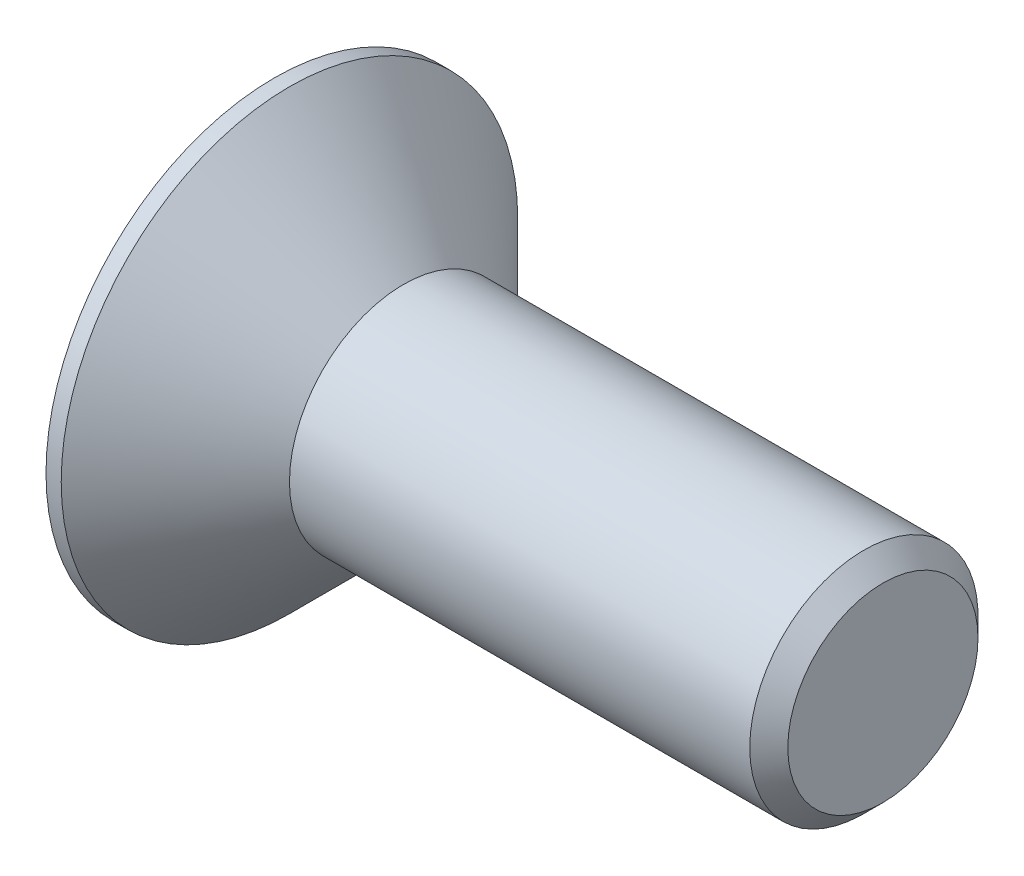
ISO-10303-21;
HEADER;
FILE_DESCRIPTION(('STEP AP214'),'2;1');
FILE_NAME('part.step','',(''),(''),'','','');
FILE_SCHEMA(('AUTOMOTIVE_DESIGN { 1 0 10303 214 1 1 1 1 }'));
ENDSEC;
DATA;
#1=APPLICATION_CONTEXT('core data for automotive mechanical design processes');
#2=APPLICATION_PROTOCOL_DEFINITION('international standard','automotive_design',2000,#1);
#3=PRODUCT_CONTEXT('',#1,'mechanical');
#4=PRODUCT('Part','Part','',(#3));
#5=PRODUCT_RELATED_PRODUCT_CATEGORY('part','',(#4));
#6=PRODUCT_DEFINITION_FORMATION('','',#4);
#7=PRODUCT_DEFINITION_CONTEXT('part definition',#1,'design');
#8=PRODUCT_DEFINITION('design','',#6,#7);
#9=PRODUCT_DEFINITION_SHAPE('','',#8);
#10=(LENGTH_UNIT() NAMED_UNIT(*) SI_UNIT(.MILLI.,.METRE.));
#11=(NAMED_UNIT(*) PLANE_ANGLE_UNIT() SI_UNIT($,.RADIAN.));
#12=(NAMED_UNIT(*) SI_UNIT($,.STERADIAN.) SOLID_ANGLE_UNIT());
#13=UNCERTAINTY_MEASURE_WITH_UNIT(LENGTH_MEASURE(1.E-05),#10,'distance_accuracy_value','');
#14=(GEOMETRIC_REPRESENTATION_CONTEXT(3) GLOBAL_UNCERTAINTY_ASSIGNED_CONTEXT((#13)) GLOBAL_UNIT_ASSIGNED_CONTEXT((#10,
#11,#12)) REPRESENTATION_CONTEXT('',''));
#15=CARTESIAN_POINT('',(0.,0.,0.));
#16=DIRECTION('',(0.,0.,1.));
#17=DIRECTION('',(1.,0.,0.));
#18=AXIS2_PLACEMENT_3D('',#15,#16,#17);
#19=CARTESIAN_POINT('',(0.,0.,0.));
#20=DIRECTION('',(1.,0.,0.));
#21=DIRECTION('',(0.,0.,-1.));
#22=AXIS2_PLACEMENT_3D('',#19,#20,#21);
#23=PLANE('',#22);
#24=DIRECTION('',(0.,0.866025403784439,0.5));
#25=VECTOR('',#24,1.);
#26=CARTESIAN_POINT('',(0.,-1.25,0.721687836487032));
#27=LINE('',#26,#25);
#28=CARTESIAN_POINT('',(0.,-1.25,0.721687836487033));
#29=VERTEX_POINT('',#28);
#30=CARTESIAN_POINT('',(0.,0.,1.44337567297406));
#31=VERTEX_POINT('',#30);
#32=EDGE_CURVE('E122',#29,#31,#27,.T.);
#33=ORIENTED_EDGE('',*,*,#32,.F.);
#34=DIRECTION('',(0.,0.,1.));
#35=VECTOR('',#34,1.);
#36=CARTESIAN_POINT('',(0.,-1.25,-0.721687836487032));
#37=LINE('',#36,#35);
#38=CARTESIAN_POINT('',(0.,-1.25,-0.721687836487032));
#39=VERTEX_POINT('',#38);
#40=EDGE_CURVE('E48',#39,#29,#37,.T.);
#41=ORIENTED_EDGE('',*,*,#40,.F.);
#42=DIRECTION('',(0.,-0.866025403784439,0.5));
#43=VECTOR('',#42,1.);
#44=CARTESIAN_POINT('',(0.,0.,-1.44337567297406));
#45=LINE('',#44,#43);
#46=CARTESIAN_POINT('',(0.,0.,-1.44337567297406));
#47=VERTEX_POINT('',#46);
#48=EDGE_CURVE('E131',#47,#39,#45,.T.);
#49=ORIENTED_EDGE('',*,*,#48,.F.);
#50=DIRECTION('',(0.,-0.866025403784439,-0.5));
#51=VECTOR('',#50,1.);
#52=CARTESIAN_POINT('',(0.,1.25,-0.721687836487032));
#53=LINE('',#52,#51);
#54=CARTESIAN_POINT('',(0.,1.25,-0.721687836487032));
#55=VERTEX_POINT('',#54);
#56=EDGE_CURVE('E129',#55,#47,#53,.T.);
#57=ORIENTED_EDGE('',*,*,#56,.F.);
#58=DIRECTION('',(0.,0.,-1.));
#59=VECTOR('',#58,1.);
#60=CARTESIAN_POINT('',(0.,1.25,0.721687836487031));
#61=LINE('',#60,#59);
#62=CARTESIAN_POINT('',(0.,1.25,0.721687836487031));
#63=VERTEX_POINT('',#62);
#64=EDGE_CURVE('E96',#63,#55,#61,.T.);
#65=ORIENTED_EDGE('',*,*,#64,.F.);
#66=DIRECTION('',(0.,0.866025403784439,-0.5));
#67=VECTOR('',#66,1.);
#68=CARTESIAN_POINT('',(0.,0.,1.44337567297406));
#69=LINE('',#68,#67);
#70=EDGE_CURVE('E125',#31,#63,#69,.T.);
#71=ORIENTED_EDGE('',*,*,#70,.F.);
#72=EDGE_LOOP('',(#33,#41,#49,#57,#65,#71));
#73=FACE_BOUND('',#72,.T.);
#74=CARTESIAN_POINT('',(0.,0.,0.));
#75=DIRECTION('',(-1.,0.,0.));
#76=DIRECTION('',(0.,0.,1.));
#77=AXIS2_PLACEMENT_3D('',#74,#75,#76);
#78=CIRCLE('',#77,3.);
#79=CARTESIAN_POINT('',(0.,0.,3.));
#80=VERTEX_POINT('',#79);
#81=EDGE_CURVE('E11',#80,#80,#78,.T.);
#82=ORIENTED_EDGE('',*,*,#81,.T.);
#83=EDGE_LOOP('',(#82));
#84=FACE_BOUND('',#83,.T.);
#85=ADVANCED_FACE('F34',(#73,#84),#23,.F.);
#86=CARTESIAN_POINT('',(-2.28184155946539,0.,0.));
#87=DIRECTION('',(-1.,0.,0.));
#88=DIRECTION('',(0.,0.,1.));
#89=AXIS2_PLACEMENT_3D('',#86,#87,#88);
#90=CYLINDRICAL_SURFACE('',#89,3.);
#91=ORIENTED_EDGE('',*,*,#81,.F.);
#92=EDGE_LOOP('',(#91));
#93=FACE_BOUND('',#92,.T.);
#94=CARTESIAN_POINT('',(0.2,0.,0.));
#95=DIRECTION('',(-1.,0.,0.));
#96=DIRECTION('',(0.,0.,1.));
#97=AXIS2_PLACEMENT_3D('',#94,#95,#96);
#98=CIRCLE('',#97,3.);
#99=CARTESIAN_POINT('',(0.2,0.,3.));
#100=VERTEX_POINT('',#99);
#101=EDGE_CURVE('E41',#100,#100,#98,.T.);
#102=ORIENTED_EDGE('',*,*,#101,.T.);
#103=EDGE_LOOP('',(#102));
#104=FACE_BOUND('',#103,.T.);
#105=ADVANCED_FACE('F151',(#93,#104),#90,.T.);
#106=CARTESIAN_POINT('',(1.69999999999999,0.,0.));
#107=DIRECTION('',(-1.,0.,0.));
#108=DIRECTION('',(0.,0.,1.));
#109=AXIS2_PLACEMENT_3D('',#106,#107,#108);
#110=CONICAL_SURFACE('',#109,1.5,0.78539816339745);
#111=ORIENTED_EDGE('',*,*,#101,.F.);
#112=EDGE_LOOP('',(#111));
#113=FACE_BOUND('',#112,.T.);
#114=CARTESIAN_POINT('',(1.69999999999999,0.,0.));
#115=DIRECTION('',(-1.,0.,0.));
#116=DIRECTION('',(0.,0.,1.));
#117=AXIS2_PLACEMENT_3D('',#114,#115,#116);
#118=CIRCLE('',#117,1.5);
#119=CARTESIAN_POINT('',(1.69999999999999,0.,1.5));
#120=VERTEX_POINT('',#119);
#121=EDGE_CURVE('E146',#120,#120,#118,.T.);
#122=ORIENTED_EDGE('',*,*,#121,.T.);
#123=EDGE_LOOP('',(#122));
#124=FACE_BOUND('',#123,.T.);
#125=ADVANCED_FACE('F153',(#113,#124),#110,.T.);
#126=CARTESIAN_POINT('',(-2.28184155946539,0.,0.));
#127=DIRECTION('',(-1.,0.,0.));
#128=DIRECTION('',(0.,0.,1.));
#129=AXIS2_PLACEMENT_3D('',#126,#127,#128);
#130=CYLINDRICAL_SURFACE('',#129,1.5);
#131=ORIENTED_EDGE('',*,*,#121,.F.);
#132=EDGE_LOOP('',(#131));
#133=FACE_BOUND('',#132,.T.);
#134=CARTESIAN_POINT('',(7.75,0.,0.));
#135=DIRECTION('',(-1.,0.,0.));
#136=DIRECTION('',(0.,0.,1.));
#137=AXIS2_PLACEMENT_3D('',#134,#135,#136);
#138=CIRCLE('',#137,1.5);
#139=CARTESIAN_POINT('',(7.75,0.,1.5));
#140=VERTEX_POINT('',#139);
#141=EDGE_CURVE('E143',#140,#140,#138,.T.);
#142=ORIENTED_EDGE('',*,*,#141,.T.);
#143=EDGE_LOOP('',(#142));
#144=FACE_BOUND('',#143,.T.);
#145=ADVANCED_FACE('F156',(#133,#144),#130,.T.);
#146=CARTESIAN_POINT('',(8.,0.,0.));
#147=DIRECTION('',(-1.,0.,0.));
#148=DIRECTION('',(0.,0.,1.));
#149=AXIS2_PLACEMENT_3D('',#146,#147,#148);
#150=CONICAL_SURFACE('',#149,1.25,0.785398163397451);
#151=ORIENTED_EDGE('',*,*,#141,.F.);
#152=EDGE_LOOP('',(#151));
#153=FACE_BOUND('',#152,.T.);
#154=CARTESIAN_POINT('',(8.,0.,0.));
#155=DIRECTION('',(-1.,0.,0.));
#156=DIRECTION('',(0.,0.,1.));
#157=AXIS2_PLACEMENT_3D('',#154,#155,#156);
#158=CIRCLE('',#157,1.25);
#159=CARTESIAN_POINT('',(8.,0.,1.25));
#160=VERTEX_POINT('',#159);
#161=EDGE_CURVE('E135',#160,#160,#158,.T.);
#162=ORIENTED_EDGE('',*,*,#161,.T.);
#163=EDGE_LOOP('',(#162));
#164=FACE_BOUND('',#163,.T.);
#165=ADVANCED_FACE('F162',(#153,#164),#150,.T.);
#166=CARTESIAN_POINT('',(8.,1.25,0.));
#167=DIRECTION('',(-1.,0.,0.));
#168=DIRECTION('',(0.,0.,1.));
#169=AXIS2_PLACEMENT_3D('',#166,#167,#168);
#170=PLANE('',#169);
#171=ORIENTED_EDGE('',*,*,#161,.F.);
#172=EDGE_LOOP('',(#171));
#173=FACE_BOUND('',#172,.T.);
#174=ADVANCED_FACE('F168',(#173),#170,.F.);
#175=CARTESIAN_POINT('',(0.8,-1.25,-0.721687836487032));
#176=DIRECTION('',(0.,-1.,0.));
#177=DIRECTION('',(0.,0.,-1.));
#178=AXIS2_PLACEMENT_3D('',#175,#176,#177);
#179=PLANE('',#178);
#180=ORIENTED_EDGE('',*,*,#40,.T.);
#181=DIRECTION('',(-1.,0.,0.));
#182=VECTOR('',#181,1.);
#183=CARTESIAN_POINT('',(0.8,-1.25,0.721687836487032));
#184=LINE('',#183,#182);
#185=CARTESIAN_POINT('',(0.8,-1.25,0.721687836487032));
#186=VERTEX_POINT('',#185);
#187=EDGE_CURVE('E78',#186,#29,#184,.T.);
#188=ORIENTED_EDGE('',*,*,#187,.F.);
#189=DIRECTION('',(0.,0.,1.));
#190=VECTOR('',#189,1.);
#191=CARTESIAN_POINT('',(0.8,-1.25,-0.721687836487032));
#192=LINE('',#191,#190);
#193=CARTESIAN_POINT('',(0.8,-1.25,-0.721687836487032));
#194=VERTEX_POINT('',#193);
#195=EDGE_CURVE('E133',#194,#186,#192,.T.);
#196=ORIENTED_EDGE('',*,*,#195,.F.);
#197=DIRECTION('',(-1.,0.,0.));
#198=VECTOR('',#197,1.);
#199=CARTESIAN_POINT('',(0.8,-1.25,-0.721687836487032));
#200=LINE('',#199,#198);
#201=EDGE_CURVE('E56',#194,#39,#200,.T.);
#202=ORIENTED_EDGE('',*,*,#201,.T.);
#203=EDGE_LOOP('',(#180,#188,#196,#202));
#204=FACE_BOUND('',#203,.T.);
#205=ADVANCED_FACE('F173',(#204),#179,.F.);
#206=CARTESIAN_POINT('',(0.8,0.,-1.44337567297406));
#207=DIRECTION('',(0.,-0.5,-0.866025403784439));
#208=DIRECTION('',(0.,0.866025403784439,-0.5));
#209=AXIS2_PLACEMENT_3D('',#206,#207,#208);
#210=PLANE('',#209);
#211=ORIENTED_EDGE('',*,*,#48,.T.);
#212=ORIENTED_EDGE('',*,*,#201,.F.);
#213=DIRECTION('',(0.,-0.866025403784439,0.5));
#214=VECTOR('',#213,1.);
#215=CARTESIAN_POINT('',(0.8,0.,-1.44337567297406));
#216=LINE('',#215,#214);
#217=CARTESIAN_POINT('',(0.8,0.,-1.44337567297406));
#218=VERTEX_POINT('',#217);
#219=EDGE_CURVE('E108',#218,#194,#216,.T.);
#220=ORIENTED_EDGE('',*,*,#219,.F.);
#221=DIRECTION('',(-1.,0.,0.));
#222=VECTOR('',#221,1.);
#223=CARTESIAN_POINT('',(0.8,0.,-1.44337567297406));
#224=LINE('',#223,#222);
#225=EDGE_CURVE('E100',#218,#47,#224,.T.);
#226=ORIENTED_EDGE('',*,*,#225,.T.);
#227=EDGE_LOOP('',(#211,#212,#220,#226));
#228=FACE_BOUND('',#227,.T.);
#229=ADVANCED_FACE('F178',(#228),#210,.F.);
#230=CARTESIAN_POINT('',(0.8,1.25,-0.721687836487032));
#231=DIRECTION('',(0.,0.5,-0.866025403784439));
#232=DIRECTION('',(0.,0.866025403784439,0.5));
#233=AXIS2_PLACEMENT_3D('',#230,#231,#232);
#234=PLANE('',#233);
#235=ORIENTED_EDGE('',*,*,#56,.T.);
#236=ORIENTED_EDGE('',*,*,#225,.F.);
#237=DIRECTION('',(0.,-0.866025403784439,-0.5));
#238=VECTOR('',#237,1.);
#239=CARTESIAN_POINT('',(0.8,1.25,-0.721687836487032));
#240=LINE('',#239,#238);
#241=CARTESIAN_POINT('',(0.8,1.25,-0.721687836487032));
#242=VERTEX_POINT('',#241);
#243=EDGE_CURVE('E104',#242,#218,#240,.T.);
#244=ORIENTED_EDGE('',*,*,#243,.F.);
#245=DIRECTION('',(-1.,0.,0.));
#246=VECTOR('',#245,1.);
#247=CARTESIAN_POINT('',(0.8,1.25,-0.721687836487032));
#248=LINE('',#247,#246);
#249=EDGE_CURVE('E89',#242,#55,#248,.T.);
#250=ORIENTED_EDGE('',*,*,#249,.T.);
#251=EDGE_LOOP('',(#235,#236,#244,#250));
#252=FACE_BOUND('',#251,.T.);
#253=ADVANCED_FACE('F105',(#252),#234,.F.);
#254=CARTESIAN_POINT('',(0.8,1.25,0.721687836487031));
#255=DIRECTION('',(0.,1.,0.));
#256=DIRECTION('',(0.,0.,1.));
#257=AXIS2_PLACEMENT_3D('',#254,#255,#256);
#258=PLANE('',#257);
#259=ORIENTED_EDGE('',*,*,#64,.T.);
#260=ORIENTED_EDGE('',*,*,#249,.F.);
#261=DIRECTION('',(0.,0.,-1.));
#262=VECTOR('',#261,1.);
#263=CARTESIAN_POINT('',(0.8,1.25,0.721687836487031));
#264=LINE('',#263,#262);
#265=CARTESIAN_POINT('',(0.8,1.25,0.721687836487031));
#266=VERTEX_POINT('',#265);
#267=EDGE_CURVE('E93',#266,#242,#264,.T.);
#268=ORIENTED_EDGE('',*,*,#267,.F.);
#269=DIRECTION('',(-1.,0.,0.));
#270=VECTOR('',#269,1.);
#271=CARTESIAN_POINT('',(0.8,1.25,0.721687836487031));
#272=LINE('',#271,#270);
#273=EDGE_CURVE('E101',#266,#63,#272,.T.);
#274=ORIENTED_EDGE('',*,*,#273,.T.);
#275=EDGE_LOOP('',(#259,#260,#268,#274));
#276=FACE_BOUND('',#275,.T.);
#277=ADVANCED_FACE('F91',(#276),#258,.F.);
#278=CARTESIAN_POINT('',(0.8,0.,1.44337567297406));
#279=DIRECTION('',(0.,0.5,0.866025403784439));
#280=DIRECTION('',(0.,-0.866025403784439,0.5));
#281=AXIS2_PLACEMENT_3D('',#278,#279,#280);
#282=PLANE('',#281);
#283=ORIENTED_EDGE('',*,*,#70,.T.);
#284=ORIENTED_EDGE('',*,*,#273,.F.);
#285=DIRECTION('',(0.,0.866025403784439,-0.5));
#286=VECTOR('',#285,1.);
#287=CARTESIAN_POINT('',(0.8,0.,1.44337567297406));
#288=LINE('',#287,#286);
#289=CARTESIAN_POINT('',(0.8,0.,1.44337567297406));
#290=VERTEX_POINT('',#289);
#291=EDGE_CURVE('E114',#290,#266,#288,.T.);
#292=ORIENTED_EDGE('',*,*,#291,.F.);
#293=DIRECTION('',(-1.,0.,0.));
#294=VECTOR('',#293,1.);
#295=CARTESIAN_POINT('',(0.8,0.,1.44337567297406));
#296=LINE('',#295,#294);
#297=EDGE_CURVE('E138',#290,#31,#296,.T.);
#298=ORIENTED_EDGE('',*,*,#297,.T.);
#299=EDGE_LOOP('',(#283,#284,#292,#298));
#300=FACE_BOUND('',#299,.T.);
#301=ADVANCED_FACE('F204',(#300),#282,.F.);
#302=CARTESIAN_POINT('',(0.8,-1.25,0.721687836487032));
#303=DIRECTION('',(0.,-0.5,0.866025403784439));
#304=DIRECTION('',(0.,-0.866025403784439,-0.5));
#305=AXIS2_PLACEMENT_3D('',#302,#303,#304);
#306=PLANE('',#305);
#307=ORIENTED_EDGE('',*,*,#32,.T.);
#308=ORIENTED_EDGE('',*,*,#297,.F.);
#309=DIRECTION('',(0.,0.866025403784439,0.5));
#310=VECTOR('',#309,1.);
#311=CARTESIAN_POINT('',(0.8,-1.25,0.721687836487032));
#312=LINE('',#311,#310);
#313=EDGE_CURVE('E116',#186,#290,#312,.T.);
#314=ORIENTED_EDGE('',*,*,#313,.F.);
#315=ORIENTED_EDGE('',*,*,#187,.T.);
#316=EDGE_LOOP('',(#307,#308,#314,#315));
#317=FACE_BOUND('',#316,.T.);
#318=ADVANCED_FACE('F192',(#317),#306,.F.);
#319=CARTESIAN_POINT('',(0.8,0.,0.));
#320=DIRECTION('',(-1.,0.,0.));
#321=DIRECTION('',(0.,0.,1.));
#322=AXIS2_PLACEMENT_3D('',#319,#320,#321);
#323=PLANE('',#322);
#324=ORIENTED_EDGE('',*,*,#195,.T.);
#325=ORIENTED_EDGE('',*,*,#313,.T.);
#326=ORIENTED_EDGE('',*,*,#291,.T.);
#327=ORIENTED_EDGE('',*,*,#267,.T.);
#328=ORIENTED_EDGE('',*,*,#243,.T.);
#329=ORIENTED_EDGE('',*,*,#219,.T.);
#330=EDGE_LOOP('',(#324,#325,#326,#327,#328,#329));
#331=FACE_BOUND('',#330,.T.);
#332=ADVANCED_FACE('F111',(#331),#323,.T.);
#333=CLOSED_SHELL('',(#85,#105,#125,#145,#165,#174,#205,#229,#253,#277,#301,#318,#332));
#334=MANIFOLD_SOLID_BREP('B2',#333);
#335=ADVANCED_BREP_SHAPE_REPRESENTATION('',(#18,#334),#14);
#336=SHAPE_DEFINITION_REPRESENTATION(#9,#335);
ENDSEC;
END-ISO-10303-21;
